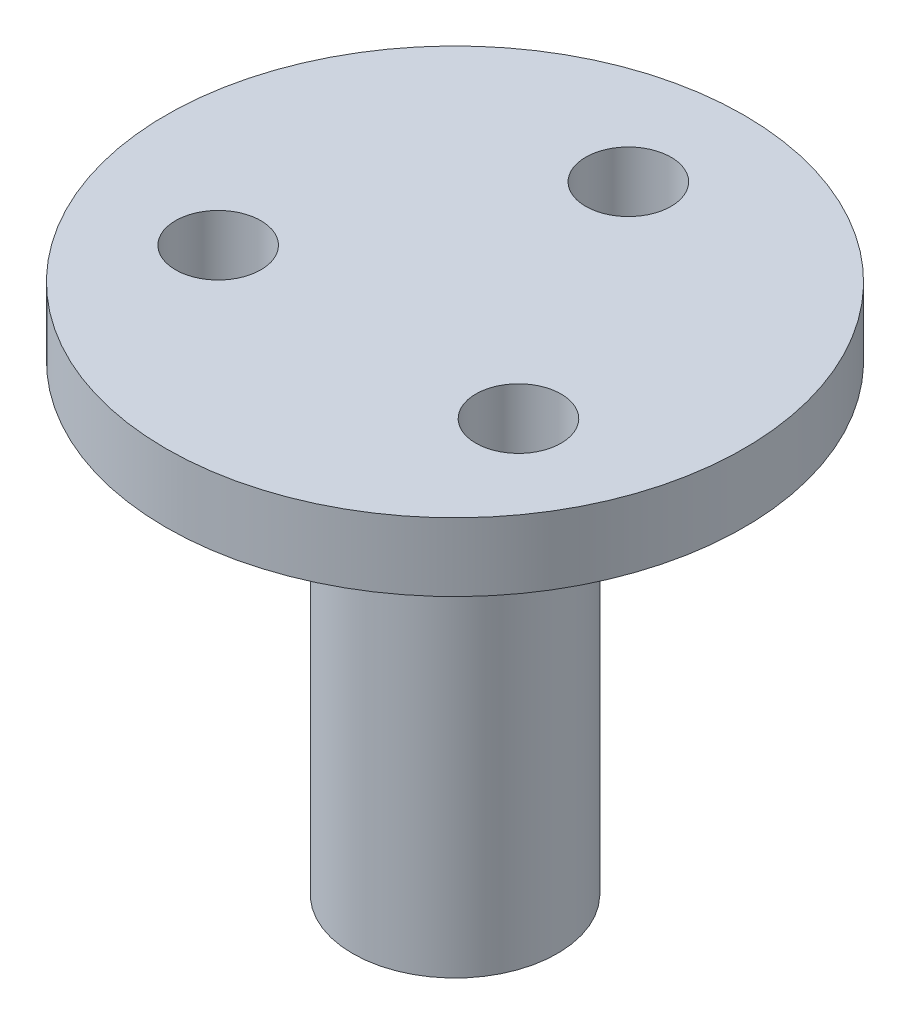
ISO-10303-21;
HEADER;
FILE_DESCRIPTION(('STEP AP214'),'2;1');
FILE_NAME('part.step','',(''),(''),'','','');
FILE_SCHEMA(('AUTOMOTIVE_DESIGN { 1 0 10303 214 1 1 1 1 }'));
ENDSEC;
DATA;
#1=APPLICATION_CONTEXT('core data for automotive mechanical design processes');
#2=APPLICATION_PROTOCOL_DEFINITION('international standard','automotive_design',2000,#1);
#3=PRODUCT_CONTEXT('',#1,'mechanical');
#4=PRODUCT('Part','Part','',(#3));
#5=PRODUCT_RELATED_PRODUCT_CATEGORY('part','',(#4));
#6=PRODUCT_DEFINITION_FORMATION('','',#4);
#7=PRODUCT_DEFINITION_CONTEXT('part definition',#1,'design');
#8=PRODUCT_DEFINITION('design','',#6,#7);
#9=PRODUCT_DEFINITION_SHAPE('','',#8);
#10=(LENGTH_UNIT() NAMED_UNIT(*) SI_UNIT(.MILLI.,.METRE.));
#11=(NAMED_UNIT(*) PLANE_ANGLE_UNIT() SI_UNIT($,.RADIAN.));
#12=(NAMED_UNIT(*) SI_UNIT($,.STERADIAN.) SOLID_ANGLE_UNIT());
#13=UNCERTAINTY_MEASURE_WITH_UNIT(LENGTH_MEASURE(1.E-05),#10,'distance_accuracy_value','');
#14=(GEOMETRIC_REPRESENTATION_CONTEXT(3) GLOBAL_UNCERTAINTY_ASSIGNED_CONTEXT((#13)) GLOBAL_UNIT_ASSIGNED_CONTEXT((#10,
#11,#12)) REPRESENTATION_CONTEXT('',''));
#15=CARTESIAN_POINT('',(0.,0.,0.));
#16=DIRECTION('',(0.,0.,1.));
#17=DIRECTION('',(1.,0.,0.));
#18=AXIS2_PLACEMENT_3D('',#15,#16,#17);
#19=CARTESIAN_POINT('',(0.,20.32,0.));
#20=DIRECTION('',(0.,-1.,0.));
#21=DIRECTION('',(0.,0.,-1.));
#22=AXIS2_PLACEMENT_3D('',#19,#20,#21);
#23=CYLINDRICAL_SURFACE('',#22,4.5);
#24=CARTESIAN_POINT('',(0.,20.32,0.));
#25=DIRECTION('',(0.,1.,0.));
#26=DIRECTION('',(0.,0.,1.));
#27=AXIS2_PLACEMENT_3D('',#24,#25,#26);
#28=CIRCLE('',#27,4.5);
#29=CARTESIAN_POINT('',(0.,20.32,4.5));
#30=VERTEX_POINT('',#29);
#31=EDGE_CURVE('E11',#30,#30,#28,.T.);
#32=ORIENTED_EDGE('',*,*,#31,.F.);
#33=EDGE_LOOP('',(#32));
#34=FACE_BOUND('',#33,.T.);
#35=CARTESIAN_POINT('',(0.,0.,0.));
#36=DIRECTION('',(0.,1.,0.));
#37=DIRECTION('',(0.,0.,1.));
#38=AXIS2_PLACEMENT_3D('',#35,#36,#37);
#39=CIRCLE('',#38,4.5);
#40=CARTESIAN_POINT('',(0.,0.,4.5));
#41=VERTEX_POINT('',#40);
#42=EDGE_CURVE('E44',#41,#41,#39,.T.);
#43=ORIENTED_EDGE('',*,*,#42,.T.);
#44=EDGE_LOOP('',(#43));
#45=FACE_BOUND('',#44,.T.);
#46=ADVANCED_FACE('F41',(#34,#45),#23,.T.);
#47=CARTESIAN_POINT('',(0.,0.,0.));
#48=DIRECTION('',(0.,1.,0.));
#49=DIRECTION('',(0.,0.,1.));
#50=AXIS2_PLACEMENT_3D('',#47,#48,#49);
#51=PLANE('',#50);
#52=DIRECTION('',(0.,0.,-1.));
#53=VECTOR('',#52,1.);
#54=CARTESIAN_POINT('',(-1.4605,0.,2.0781096578381));
#55=LINE('',#54,#53);
#56=CARTESIAN_POINT('',(-1.4605,0.,2.0781096578381));
#57=VERTEX_POINT('',#56);
#58=CARTESIAN_POINT('',(-1.4605,0.,-2.0781096578381));
#59=VERTEX_POINT('',#58);
#60=EDGE_CURVE('E91',#57,#59,#55,.T.);
#61=ORIENTED_EDGE('',*,*,#60,.F.);
#62=CARTESIAN_POINT('',(0.,0.,0.));
#63=DIRECTION('',(0.,-1.,0.));
#64=DIRECTION('',(0.,0.,-1.));
#65=AXIS2_PLACEMENT_3D('',#62,#63,#64);
#66=CIRCLE('',#65,2.54);
#67=CARTESIAN_POINT('',(1.4605,0.,2.0781096578381));
#68=VERTEX_POINT('',#67);
#69=EDGE_CURVE('E56',#68,#57,#66,.T.);
#70=ORIENTED_EDGE('',*,*,#69,.F.);
#71=DIRECTION('',(0.,0.,1.));
#72=VECTOR('',#71,1.);
#73=CARTESIAN_POINT('',(1.4605,0.,2.0781096578381));
#74=LINE('',#73,#72);
#75=CARTESIAN_POINT('',(1.4605,0.,-2.0781096578381));
#76=VERTEX_POINT('',#75);
#77=EDGE_CURVE('E111',#76,#68,#74,.T.);
#78=ORIENTED_EDGE('',*,*,#77,.F.);
#79=CARTESIAN_POINT('',(0.,0.,0.));
#80=DIRECTION('',(0.,-1.,0.));
#81=DIRECTION('',(0.,0.,-1.));
#82=AXIS2_PLACEMENT_3D('',#79,#80,#81);
#83=CIRCLE('',#82,2.54);
#84=EDGE_CURVE('E120',#59,#76,#83,.T.);
#85=ORIENTED_EDGE('',*,*,#84,.F.);
#86=EDGE_LOOP('',(#61,#70,#78,#85));
#87=FACE_BOUND('',#86,.T.);
#88=ORIENTED_EDGE('',*,*,#42,.F.);
#89=EDGE_LOOP('',(#88));
#90=FACE_BOUND('',#89,.T.);
#91=ADVANCED_FACE('F194',(#87,#90),#51,.F.);
#92=CARTESIAN_POINT('',(0.,23.32,0.));
#93=DIRECTION('',(0.,1.,0.));
#94=DIRECTION('',(0.,0.,1.));
#95=AXIS2_PLACEMENT_3D('',#92,#93,#94);
#96=PLANE('',#95);
#97=CARTESIAN_POINT('',(6.59911357683774,23.32,3.80999999999981));
#98=DIRECTION('',(0.,1.,0.));
#99=DIRECTION('',(0.,0.,1.));
#100=AXIS2_PLACEMENT_3D('',#97,#98,#99);
#101=CIRCLE('',#100,1.875);
#102=CARTESIAN_POINT('',(6.59911357683774,23.32,5.68499999999981));
#103=VERTEX_POINT('',#102);
#104=EDGE_CURVE('E140',#103,#103,#101,.T.);
#105=ORIENTED_EDGE('',*,*,#104,.F.);
#106=EDGE_LOOP('',(#105));
#107=FACE_BOUND('',#106,.T.);
#108=CARTESIAN_POINT('',(0.,23.32,0.));
#109=DIRECTION('',(0.,1.,0.));
#110=DIRECTION('',(0.,0.,1.));
#111=AXIS2_PLACEMENT_3D('',#108,#109,#110);
#112=CIRCLE('',#111,12.7);
#113=CARTESIAN_POINT('',(0.,23.32,12.7));
#114=VERTEX_POINT('',#113);
#115=EDGE_CURVE('E156',#114,#114,#112,.T.);
#116=ORIENTED_EDGE('',*,*,#115,.T.);
#117=EDGE_LOOP('',(#116));
#118=FACE_BOUND('',#117,.T.);
#119=CARTESIAN_POINT('',(0.,23.32,-7.62));
#120=DIRECTION('',(0.,1.,0.));
#121=DIRECTION('',(0.,0.,1.));
#122=AXIS2_PLACEMENT_3D('',#119,#120,#121);
#123=CIRCLE('',#122,1.875);
#124=CARTESIAN_POINT('',(0.,23.32,-5.745));
#125=VERTEX_POINT('',#124);
#126=EDGE_CURVE('E148',#125,#125,#123,.T.);
#127=ORIENTED_EDGE('',*,*,#126,.F.);
#128=EDGE_LOOP('',(#127));
#129=FACE_BOUND('',#128,.T.);
#130=CARTESIAN_POINT('',(-6.5991135768371,23.32,3.81000000000019));
#131=DIRECTION('',(0.,1.,0.));
#132=DIRECTION('',(0.,0.,1.));
#133=AXIS2_PLACEMENT_3D('',#130,#131,#132);
#134=CIRCLE('',#133,1.875);
#135=CARTESIAN_POINT('',(-6.5991135768371,23.32,5.68500000000019));
#136=VERTEX_POINT('',#135);
#137=EDGE_CURVE('E132',#136,#136,#134,.T.);
#138=ORIENTED_EDGE('',*,*,#137,.F.);
#139=EDGE_LOOP('',(#138));
#140=FACE_BOUND('',#139,.T.);
#141=ADVANCED_FACE('F169',(#107,#118,#129,#140),#96,.T.);
#142=CARTESIAN_POINT('',(0.,20.32,0.));
#143=DIRECTION('',(0.,1.,0.));
#144=DIRECTION('',(0.,0.,1.));
#145=AXIS2_PLACEMENT_3D('',#142,#143,#144);
#146=PLANE('',#145);
#147=ORIENTED_EDGE('',*,*,#31,.T.);
#148=EDGE_LOOP('',(#147));
#149=FACE_BOUND('',#148,.T.);
#150=CARTESIAN_POINT('',(0.,20.32,0.));
#151=DIRECTION('',(0.,1.,0.));
#152=DIRECTION('',(0.,0.,1.));
#153=AXIS2_PLACEMENT_3D('',#150,#151,#152);
#154=CIRCLE('',#153,12.7);
#155=CARTESIAN_POINT('',(0.,20.32,12.7));
#156=VERTEX_POINT('',#155);
#157=EDGE_CURVE('E152',#156,#156,#154,.T.);
#158=ORIENTED_EDGE('',*,*,#157,.F.);
#159=EDGE_LOOP('',(#158));
#160=FACE_BOUND('',#159,.T.);
#161=CARTESIAN_POINT('',(0.,20.32,-7.62));
#162=DIRECTION('',(0.,1.,0.));
#163=DIRECTION('',(0.,0.,1.));
#164=AXIS2_PLACEMENT_3D('',#161,#162,#163);
#165=CIRCLE('',#164,1.875);
#166=CARTESIAN_POINT('',(0.,20.32,-5.745));
#167=VERTEX_POINT('',#166);
#168=EDGE_CURVE('E144',#167,#167,#165,.T.);
#169=ORIENTED_EDGE('',*,*,#168,.T.);
#170=EDGE_LOOP('',(#169));
#171=FACE_BOUND('',#170,.T.);
#172=CARTESIAN_POINT('',(6.59911357683774,20.32,3.80999999999981));
#173=DIRECTION('',(0.,1.,0.));
#174=DIRECTION('',(0.,0.,1.));
#175=AXIS2_PLACEMENT_3D('',#172,#173,#174);
#176=CIRCLE('',#175,1.875);
#177=CARTESIAN_POINT('',(6.59911357683774,20.32,5.68499999999981));
#178=VERTEX_POINT('',#177);
#179=EDGE_CURVE('E136',#178,#178,#176,.T.);
#180=ORIENTED_EDGE('',*,*,#179,.T.);
#181=EDGE_LOOP('',(#180));
#182=FACE_BOUND('',#181,.T.);
#183=CARTESIAN_POINT('',(-6.5991135768371,20.32,3.81000000000019));
#184=DIRECTION('',(0.,1.,0.));
#185=DIRECTION('',(0.,0.,1.));
#186=AXIS2_PLACEMENT_3D('',#183,#184,#185);
#187=CIRCLE('',#186,1.875);
#188=CARTESIAN_POINT('',(-6.5991135768371,20.32,5.68500000000019));
#189=VERTEX_POINT('',#188);
#190=EDGE_CURVE('E127',#189,#189,#187,.T.);
#191=ORIENTED_EDGE('',*,*,#190,.T.);
#192=EDGE_LOOP('',(#191));
#193=FACE_BOUND('',#192,.T.);
#194=ADVANCED_FACE('F166',(#149,#160,#171,#182,#193),#146,.F.);
#195=CARTESIAN_POINT('',(0.,23.32,0.));
#196=DIRECTION('',(0.,-1.,0.));
#197=DIRECTION('',(0.,0.,-1.));
#198=AXIS2_PLACEMENT_3D('',#195,#196,#197);
#199=CYLINDRICAL_SURFACE('',#198,12.7);
#200=ORIENTED_EDGE('',*,*,#115,.F.);
#201=EDGE_LOOP('',(#200));
#202=FACE_BOUND('',#201,.T.);
#203=ORIENTED_EDGE('',*,*,#157,.T.);
#204=EDGE_LOOP('',(#203));
#205=FACE_BOUND('',#204,.T.);
#206=ADVANCED_FACE('F164',(#202,#205),#199,.T.);
#207=CARTESIAN_POINT('',(0.,23.32,-7.62));
#208=DIRECTION('',(0.,-1.,0.));
#209=DIRECTION('',(0.,0.,-1.));
#210=AXIS2_PLACEMENT_3D('',#207,#208,#209);
#211=CYLINDRICAL_SURFACE('',#210,1.875);
#212=ORIENTED_EDGE('',*,*,#126,.T.);
#213=EDGE_LOOP('',(#212));
#214=FACE_BOUND('',#213,.T.);
#215=ORIENTED_EDGE('',*,*,#168,.F.);
#216=EDGE_LOOP('',(#215));
#217=FACE_BOUND('',#216,.T.);
#218=ADVANCED_FACE('F190',(#214,#217),#211,.F.);
#219=CARTESIAN_POINT('',(6.59911357683774,23.32,3.80999999999981));
#220=DIRECTION('',(0.,-1.,0.));
#221=DIRECTION('',(0.,0.,-1.));
#222=AXIS2_PLACEMENT_3D('',#219,#220,#221);
#223=CYLINDRICAL_SURFACE('',#222,1.875);
#224=ORIENTED_EDGE('',*,*,#104,.T.);
#225=EDGE_LOOP('',(#224));
#226=FACE_BOUND('',#225,.T.);
#227=ORIENTED_EDGE('',*,*,#179,.F.);
#228=EDGE_LOOP('',(#227));
#229=FACE_BOUND('',#228,.T.);
#230=ADVANCED_FACE('F181',(#226,#229),#223,.F.);
#231=CARTESIAN_POINT('',(-6.5991135768371,23.32,3.81000000000019));
#232=DIRECTION('',(0.,-1.,0.));
#233=DIRECTION('',(0.,0.,-1.));
#234=AXIS2_PLACEMENT_3D('',#231,#232,#233);
#235=CYLINDRICAL_SURFACE('',#234,1.875);
#236=ORIENTED_EDGE('',*,*,#137,.T.);
#237=EDGE_LOOP('',(#236));
#238=FACE_BOUND('',#237,.T.);
#239=ORIENTED_EDGE('',*,*,#190,.F.);
#240=EDGE_LOOP('',(#239));
#241=FACE_BOUND('',#240,.T.);
#242=ADVANCED_FACE('F178',(#238,#241),#235,.F.);
#243=CARTESIAN_POINT('',(0.,5.842,0.));
#244=DIRECTION('',(0.,-1.,0.));
#245=DIRECTION('',(0.,0.,-1.));
#246=AXIS2_PLACEMENT_3D('',#243,#244,#245);
#247=CYLINDRICAL_SURFACE('',#246,2.54);
#248=ORIENTED_EDGE('',*,*,#69,.T.);
#249=DIRECTION('',(0.,-1.,0.));
#250=VECTOR('',#249,1.);
#251=CARTESIAN_POINT('',(-1.4605,5.842,2.0781096578381));
#252=LINE('',#251,#250);
#253=CARTESIAN_POINT('',(-1.4605,5.842,2.0781096578381));
#254=VERTEX_POINT('',#253);
#255=EDGE_CURVE('E79',#254,#57,#252,.T.);
#256=ORIENTED_EDGE('',*,*,#255,.F.);
#257=CARTESIAN_POINT('',(0.,5.842,0.));
#258=DIRECTION('',(0.,-1.,0.));
#259=DIRECTION('',(0.,0.,-1.));
#260=AXIS2_PLACEMENT_3D('',#257,#258,#259);
#261=CIRCLE('',#260,2.54);
#262=CARTESIAN_POINT('',(1.4605,5.842,2.0781096578381));
#263=VERTEX_POINT('',#262);
#264=EDGE_CURVE('E107',#263,#254,#261,.T.);
#265=ORIENTED_EDGE('',*,*,#264,.F.);
#266=DIRECTION('',(0.,-1.,0.));
#267=VECTOR('',#266,1.);
#268=CARTESIAN_POINT('',(1.4605,5.842,2.0781096578381));
#269=LINE('',#268,#267);
#270=EDGE_CURVE('E64',#263,#68,#269,.T.);
#271=ORIENTED_EDGE('',*,*,#270,.T.);
#272=EDGE_LOOP('',(#248,#256,#265,#271));
#273=FACE_BOUND('',#272,.T.);
#274=ADVANCED_FACE('F180',(#273),#247,.F.);
#275=CARTESIAN_POINT('',(1.4605,5.842,2.0781096578381));
#276=DIRECTION('',(1.,0.,0.));
#277=DIRECTION('',(0.,0.,-1.));
#278=AXIS2_PLACEMENT_3D('',#275,#276,#277);
#279=PLANE('',#278);
#280=ORIENTED_EDGE('',*,*,#77,.T.);
#281=ORIENTED_EDGE('',*,*,#270,.F.);
#282=DIRECTION('',(0.,0.,1.));
#283=VECTOR('',#282,1.);
#284=CARTESIAN_POINT('',(1.4605,5.842,2.0781096578381));
#285=LINE('',#284,#283);
#286=CARTESIAN_POINT('',(1.4605,5.842,-2.0781096578381));
#287=VERTEX_POINT('',#286);
#288=EDGE_CURVE('E104',#287,#263,#285,.T.);
#289=ORIENTED_EDGE('',*,*,#288,.F.);
#290=DIRECTION('',(0.,-1.,0.));
#291=VECTOR('',#290,1.);
#292=CARTESIAN_POINT('',(1.4605,5.842,-2.0781096578381));
#293=LINE('',#292,#291);
#294=EDGE_CURVE('E96',#287,#76,#293,.T.);
#295=ORIENTED_EDGE('',*,*,#294,.T.);
#296=EDGE_LOOP('',(#280,#281,#289,#295));
#297=FACE_BOUND('',#296,.T.);
#298=ADVANCED_FACE('F188',(#297),#279,.F.);
#299=CARTESIAN_POINT('',(0.,5.842,0.));
#300=DIRECTION('',(0.,-1.,0.));
#301=DIRECTION('',(0.,0.,-1.));
#302=AXIS2_PLACEMENT_3D('',#299,#300,#301);
#303=CYLINDRICAL_SURFACE('',#302,2.54);
#304=ORIENTED_EDGE('',*,*,#84,.T.);
#305=ORIENTED_EDGE('',*,*,#294,.F.);
#306=CARTESIAN_POINT('',(0.,5.842,0.));
#307=DIRECTION('',(0.,-1.,0.));
#308=DIRECTION('',(0.,0.,-1.));
#309=AXIS2_PLACEMENT_3D('',#306,#307,#308);
#310=CIRCLE('',#309,2.54);
#311=CARTESIAN_POINT('',(-1.4605,5.842,-2.0781096578381));
#312=VERTEX_POINT('',#311);
#313=EDGE_CURVE('E99',#312,#287,#310,.T.);
#314=ORIENTED_EDGE('',*,*,#313,.F.);
#315=DIRECTION('',(0.,-1.,0.));
#316=VECTOR('',#315,1.);
#317=CARTESIAN_POINT('',(-1.4605,5.842,-2.0781096578381));
#318=LINE('',#317,#316);
#319=EDGE_CURVE('E84',#312,#59,#318,.T.);
#320=ORIENTED_EDGE('',*,*,#319,.T.);
#321=EDGE_LOOP('',(#304,#305,#314,#320));
#322=FACE_BOUND('',#321,.T.);
#323=ADVANCED_FACE('F100',(#322),#303,.F.);
#324=CARTESIAN_POINT('',(-1.4605,5.842,2.0781096578381));
#325=DIRECTION('',(-1.,0.,0.));
#326=DIRECTION('',(0.,0.,1.));
#327=AXIS2_PLACEMENT_3D('',#324,#325,#326);
#328=PLANE('',#327);
#329=ORIENTED_EDGE('',*,*,#60,.T.);
#330=ORIENTED_EDGE('',*,*,#319,.F.);
#331=DIRECTION('',(0.,0.,-1.));
#332=VECTOR('',#331,1.);
#333=CARTESIAN_POINT('',(-1.4605,5.842,2.0781096578381));
#334=LINE('',#333,#332);
#335=EDGE_CURVE('E88',#254,#312,#334,.T.);
#336=ORIENTED_EDGE('',*,*,#335,.F.);
#337=ORIENTED_EDGE('',*,*,#255,.T.);
#338=EDGE_LOOP('',(#329,#330,#336,#337));
#339=FACE_BOUND('',#338,.T.);
#340=ADVANCED_FACE('F86',(#339),#328,.F.);
#341=CARTESIAN_POINT('',(0.,5.842,0.));
#342=DIRECTION('',(0.,-1.,0.));
#343=DIRECTION('',(0.,0.,-1.));
#344=AXIS2_PLACEMENT_3D('',#341,#342,#343);
#345=PLANE('',#344);
#346=ORIENTED_EDGE('',*,*,#264,.T.);
#347=ORIENTED_EDGE('',*,*,#335,.T.);
#348=ORIENTED_EDGE('',*,*,#313,.T.);
#349=ORIENTED_EDGE('',*,*,#288,.T.);
#350=EDGE_LOOP('',(#346,#347,#348,#349));
#351=FACE_BOUND('',#350,.T.);
#352=ADVANCED_FACE('F106',(#351),#345,.T.);
#353=CLOSED_SHELL('',(#46,#91,#141,#194,#206,#218,#230,#242,#274,#298,#323,#340,#352));
#354=MANIFOLD_SOLID_BREP('B2',#353);
#355=ADVANCED_BREP_SHAPE_REPRESENTATION('',(#18,#354),#14);
#356=SHAPE_DEFINITION_REPRESENTATION(#9,#355);
ENDSEC;
END-ISO-10303-21;
